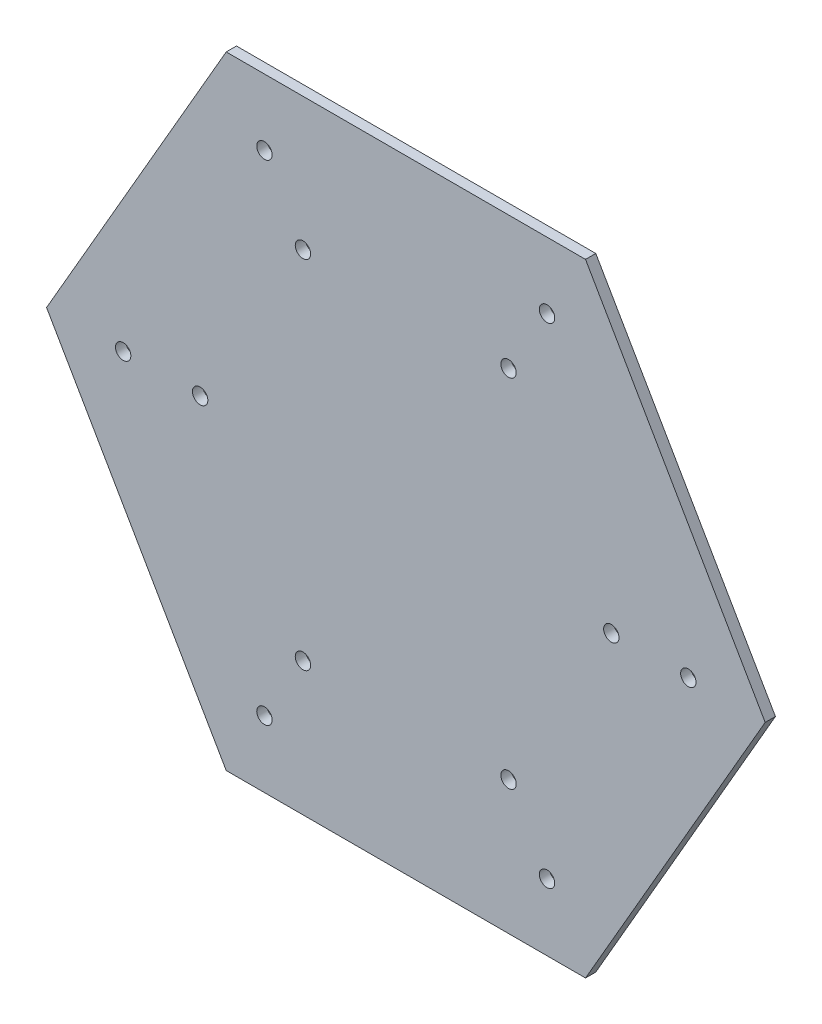
ISO-10303-21;
HEADER;
FILE_DESCRIPTION(('STEP AP214'),'2;1');
FILE_NAME('part.step','',(''),(''),'','','');
FILE_SCHEMA(('AUTOMOTIVE_DESIGN { 1 0 10303 214 1 1 1 1 }'));
ENDSEC;
DATA;
#1=APPLICATION_CONTEXT('core data for automotive mechanical design processes');
#2=APPLICATION_PROTOCOL_DEFINITION('international standard','automotive_design',2000,#1);
#3=PRODUCT_CONTEXT('',#1,'mechanical');
#4=PRODUCT('Part','Part','',(#3));
#5=PRODUCT_RELATED_PRODUCT_CATEGORY('part','',(#4));
#6=PRODUCT_DEFINITION_FORMATION('','',#4);
#7=PRODUCT_DEFINITION_CONTEXT('part definition',#1,'design');
#8=PRODUCT_DEFINITION('design','',#6,#7);
#9=PRODUCT_DEFINITION_SHAPE('','',#8);
#10=(LENGTH_UNIT() NAMED_UNIT(*) SI_UNIT(.MILLI.,.METRE.));
#11=(NAMED_UNIT(*) PLANE_ANGLE_UNIT() SI_UNIT($,.RADIAN.));
#12=(NAMED_UNIT(*) SI_UNIT($,.STERADIAN.) SOLID_ANGLE_UNIT());
#13=UNCERTAINTY_MEASURE_WITH_UNIT(LENGTH_MEASURE(1.E-05),#10,'distance_accuracy_value','');
#14=(GEOMETRIC_REPRESENTATION_CONTEXT(3) GLOBAL_UNCERTAINTY_ASSIGNED_CONTEXT((#13)) GLOBAL_UNIT_ASSIGNED_CONTEXT((#10,
#11,#12)) REPRESENTATION_CONTEXT('',''));
#15=CARTESIAN_POINT('',(0.,0.,0.));
#16=DIRECTION('',(0.,0.,1.));
#17=DIRECTION('',(1.,0.,0.));
#18=AXIS2_PLACEMENT_3D('',#15,#16,#17);
#19=CARTESIAN_POINT('',(-35.,-60.6217782649107,2.));
#20=DIRECTION('',(0.,1.,0.));
#21=DIRECTION('',(-1.,0.,0.));
#22=AXIS2_PLACEMENT_3D('',#19,#20,#21);
#23=PLANE('',#22);
#24=DIRECTION('',(1.,0.,0.));
#25=VECTOR('',#24,1.);
#26=CARTESIAN_POINT('',(-35.,-60.6217782649107,0.));
#27=LINE('',#26,#25);
#28=CARTESIAN_POINT('',(-35.,-60.6217782649107,0.));
#29=VERTEX_POINT('',#28);
#30=CARTESIAN_POINT('',(35.,-60.6217782649107,0.));
#31=VERTEX_POINT('',#30);
#32=EDGE_CURVE('E130',#29,#31,#27,.T.);
#33=ORIENTED_EDGE('',*,*,#32,.T.);
#34=DIRECTION('',(0.,0.,-1.));
#35=VECTOR('',#34,1.);
#36=CARTESIAN_POINT('',(35.,-60.6217782649107,2.));
#37=LINE('',#36,#35);
#38=CARTESIAN_POINT('',(35.,-60.6217782649107,2.));
#39=VERTEX_POINT('',#38);
#40=EDGE_CURVE('E11',#39,#31,#37,.T.);
#41=ORIENTED_EDGE('',*,*,#40,.F.);
#42=DIRECTION('',(1.,0.,0.));
#43=VECTOR('',#42,1.);
#44=CARTESIAN_POINT('',(-35.,-60.6217782649107,2.));
#45=LINE('',#44,#43);
#46=CARTESIAN_POINT('',(-35.,-60.6217782649107,2.));
#47=VERTEX_POINT('',#46);
#48=EDGE_CURVE('E147',#47,#39,#45,.T.);
#49=ORIENTED_EDGE('',*,*,#48,.F.);
#50=DIRECTION('',(0.,0.,-1.));
#51=VECTOR('',#50,1.);
#52=CARTESIAN_POINT('',(-35.,-60.6217782649107,2.));
#53=LINE('',#52,#51);
#54=EDGE_CURVE('E126',#47,#29,#53,.T.);
#55=ORIENTED_EDGE('',*,*,#54,.T.);
#56=EDGE_LOOP('',(#33,#41,#49,#55));
#57=FACE_BOUND('',#56,.T.);
#58=ADVANCED_FACE('F41',(#57),#23,.F.);
#59=CARTESIAN_POINT('',(35.,-60.6217782649107,2.));
#60=DIRECTION('',(-0.866025403784439,0.5,0.));
#61=DIRECTION('',(-0.5,-0.866025403784439,0.));
#62=AXIS2_PLACEMENT_3D('',#59,#60,#61);
#63=PLANE('',#62);
#64=DIRECTION('',(0.5,0.866025403784439,0.));
#65=VECTOR('',#64,1.);
#66=CARTESIAN_POINT('',(35.,-60.6217782649107,0.));
#67=LINE('',#66,#65);
#68=CARTESIAN_POINT('',(70.,0.,0.));
#69=VERTEX_POINT('',#68);
#70=EDGE_CURVE('E134',#31,#69,#67,.T.);
#71=ORIENTED_EDGE('',*,*,#70,.T.);
#72=DIRECTION('',(0.,0.,-1.));
#73=VECTOR('',#72,1.);
#74=CARTESIAN_POINT('',(70.,0.,2.));
#75=LINE('',#74,#73);
#76=CARTESIAN_POINT('',(70.,0.,2.));
#77=VERTEX_POINT('',#76);
#78=EDGE_CURVE('E50',#77,#69,#75,.T.);
#79=ORIENTED_EDGE('',*,*,#78,.F.);
#80=DIRECTION('',(0.5,0.866025403784439,0.));
#81=VECTOR('',#80,1.);
#82=CARTESIAN_POINT('',(35.,-60.6217782649107,2.));
#83=LINE('',#82,#81);
#84=EDGE_CURVE('E95',#39,#77,#83,.T.);
#85=ORIENTED_EDGE('',*,*,#84,.F.);
#86=ORIENTED_EDGE('',*,*,#40,.T.);
#87=EDGE_LOOP('',(#71,#79,#85,#86));
#88=FACE_BOUND('',#87,.T.);
#89=ADVANCED_FACE('F176',(#88),#63,.F.);
#90=CARTESIAN_POINT('',(70.,0.,2.));
#91=DIRECTION('',(-0.866025403784439,-0.5,0.));
#92=DIRECTION('',(0.5,-0.866025403784439,0.));
#93=AXIS2_PLACEMENT_3D('',#90,#91,#92);
#94=PLANE('',#93);
#95=DIRECTION('',(-0.5,0.866025403784439,0.));
#96=VECTOR('',#95,1.);
#97=CARTESIAN_POINT('',(70.,0.,0.));
#98=LINE('',#97,#96);
#99=CARTESIAN_POINT('',(35.,60.6217782649107,0.));
#100=VERTEX_POINT('',#99);
#101=EDGE_CURVE('E138',#69,#100,#98,.T.);
#102=ORIENTED_EDGE('',*,*,#101,.T.);
#103=DIRECTION('',(0.,0.,-1.));
#104=VECTOR('',#103,1.);
#105=CARTESIAN_POINT('',(35.,60.6217782649107,2.));
#106=LINE('',#105,#104);
#107=CARTESIAN_POINT('',(35.,60.6217782649107,2.));
#108=VERTEX_POINT('',#107);
#109=EDGE_CURVE('E119',#108,#100,#106,.T.);
#110=ORIENTED_EDGE('',*,*,#109,.F.);
#111=DIRECTION('',(-0.5,0.866025403784439,0.));
#112=VECTOR('',#111,1.);
#113=CARTESIAN_POINT('',(70.,0.,2.));
#114=LINE('',#113,#112);
#115=EDGE_CURVE('E108',#77,#108,#114,.T.);
#116=ORIENTED_EDGE('',*,*,#115,.F.);
#117=ORIENTED_EDGE('',*,*,#78,.T.);
#118=EDGE_LOOP('',(#102,#110,#116,#117));
#119=FACE_BOUND('',#118,.T.);
#120=ADVANCED_FACE('F157',(#119),#94,.F.);
#121=CARTESIAN_POINT('',(35.,60.6217782649107,2.));
#122=DIRECTION('',(0.,-1.,0.));
#123=DIRECTION('',(1.,0.,0.));
#124=AXIS2_PLACEMENT_3D('',#121,#122,#123);
#125=PLANE('',#124);
#126=DIRECTION('',(-1.,0.,0.));
#127=VECTOR('',#126,1.);
#128=CARTESIAN_POINT('',(35.,60.6217782649107,0.));
#129=LINE('',#128,#127);
#130=CARTESIAN_POINT('',(-35.,60.6217782649107,0.));
#131=VERTEX_POINT('',#130);
#132=EDGE_CURVE('E117',#100,#131,#129,.T.);
#133=ORIENTED_EDGE('',*,*,#132,.T.);
#134=DIRECTION('',(0.,0.,-1.));
#135=VECTOR('',#134,1.);
#136=CARTESIAN_POINT('',(-35.,60.6217782649107,2.));
#137=LINE('',#136,#135);
#138=CARTESIAN_POINT('',(-35.,60.6217782649107,2.));
#139=VERTEX_POINT('',#138);
#140=EDGE_CURVE('E114',#139,#131,#137,.T.);
#141=ORIENTED_EDGE('',*,*,#140,.F.);
#142=DIRECTION('',(-1.,0.,0.));
#143=VECTOR('',#142,1.);
#144=CARTESIAN_POINT('',(35.,60.6217782649107,2.));
#145=LINE('',#144,#143);
#146=EDGE_CURVE('E102',#108,#139,#145,.T.);
#147=ORIENTED_EDGE('',*,*,#146,.F.);
#148=ORIENTED_EDGE('',*,*,#109,.T.);
#149=EDGE_LOOP('',(#133,#141,#147,#148));
#150=FACE_BOUND('',#149,.T.);
#151=ADVANCED_FACE('F115',(#150),#125,.F.);
#152=CARTESIAN_POINT('',(-35.,60.6217782649107,2.));
#153=DIRECTION('',(0.866025403784438,-0.5,0.));
#154=DIRECTION('',(0.5,0.866025403784439,0.));
#155=AXIS2_PLACEMENT_3D('',#152,#153,#154);
#156=PLANE('',#155);
#157=DIRECTION('',(-0.5,-0.866025403784439,0.));
#158=VECTOR('',#157,1.);
#159=CARTESIAN_POINT('',(-35.,60.6217782649107,0.));
#160=LINE('',#159,#158);
#161=CARTESIAN_POINT('',(-70.,0.,0.));
#162=VERTEX_POINT('',#161);
#163=EDGE_CURVE('E81',#131,#162,#160,.T.);
#164=ORIENTED_EDGE('',*,*,#163,.T.);
#165=DIRECTION('',(0.,0.,-1.));
#166=VECTOR('',#165,1.);
#167=CARTESIAN_POINT('',(-70.,0.,2.));
#168=LINE('',#167,#166);
#169=CARTESIAN_POINT('',(-70.,0.,2.));
#170=VERTEX_POINT('',#169);
#171=EDGE_CURVE('E120',#170,#162,#168,.T.);
#172=ORIENTED_EDGE('',*,*,#171,.F.);
#173=DIRECTION('',(-0.5,-0.866025403784439,0.));
#174=VECTOR('',#173,1.);
#175=CARTESIAN_POINT('',(-35.,60.6217782649107,2.));
#176=LINE('',#175,#174);
#177=EDGE_CURVE('E106',#139,#170,#176,.T.);
#178=ORIENTED_EDGE('',*,*,#177,.F.);
#179=ORIENTED_EDGE('',*,*,#140,.T.);
#180=EDGE_LOOP('',(#164,#172,#178,#179));
#181=FACE_BOUND('',#180,.T.);
#182=ADVANCED_FACE('F122',(#181),#156,.F.);
#183=CARTESIAN_POINT('',(-70.,0.,2.));
#184=DIRECTION('',(0.866025403784439,0.5,0.));
#185=DIRECTION('',(-0.5,0.866025403784439,0.));
#186=AXIS2_PLACEMENT_3D('',#183,#184,#185);
#187=PLANE('',#186);
#188=DIRECTION('',(0.5,-0.866025403784439,0.));
#189=VECTOR('',#188,1.);
#190=CARTESIAN_POINT('',(-70.,0.,0.));
#191=LINE('',#190,#189);
#192=EDGE_CURVE('E87',#162,#29,#191,.T.);
#193=ORIENTED_EDGE('',*,*,#192,.T.);
#194=ORIENTED_EDGE('',*,*,#54,.F.);
#195=DIRECTION('',(0.5,-0.866025403784439,0.));
#196=VECTOR('',#195,1.);
#197=CARTESIAN_POINT('',(-70.,0.,2.));
#198=LINE('',#197,#196);
#199=EDGE_CURVE('E58',#170,#47,#198,.T.);
#200=ORIENTED_EDGE('',*,*,#199,.F.);
#201=ORIENTED_EDGE('',*,*,#171,.T.);
#202=EDGE_LOOP('',(#193,#194,#200,#201));
#203=FACE_BOUND('',#202,.T.);
#204=ADVANCED_FACE('F164',(#203),#187,.F.);
#205=CARTESIAN_POINT('',(0.,0.,2.));
#206=DIRECTION('',(0.,0.,1.));
#207=DIRECTION('',(1.,0.,0.));
#208=AXIS2_PLACEMENT_3D('',#205,#206,#207);
#209=PLANE('',#208);
#210=CARTESIAN_POINT('',(55.0264034441536,0.0457321067688558,2.));
#211=DIRECTION('',(0.,0.,1.));
#212=DIRECTION('',(0.499999999999998,0.86602540378444,0.));
#213=AXIS2_PLACEMENT_3D('',#210,#211,#212);
#214=CIRCLE('',#213,1.5);
#215=CARTESIAN_POINT('',(55.7764034441536,1.34477021244552,2.));
#216=VERTEX_POINT('',#215);
#217=EDGE_CURVE('E340',#216,#216,#214,.T.);
#218=ORIENTED_EDGE('',*,*,#217,.F.);
#219=EDGE_LOOP('',(#218));
#220=FACE_BOUND('',#219,.T.);
#221=CARTESIAN_POINT('',(-20.0528068883067,-34.6410161513778,2.));
#222=DIRECTION('',(0.,0.,1.));
#223=DIRECTION('',(0.50000000000001,-0.866025403784433,0.));
#224=AXIS2_PLACEMENT_3D('',#221,#222,#223);
#225=CIRCLE('',#224,1.5);
#226=CARTESIAN_POINT('',(-19.3028068883067,-35.9400542570545,2.));
#227=VERTEX_POINT('',#226);
#228=EDGE_CURVE('E355',#227,#227,#225,.T.);
#229=ORIENTED_EDGE('',*,*,#228,.F.);
#230=EDGE_LOOP('',(#229));
#231=FACE_BOUND('',#230,.T.);
#232=CARTESIAN_POINT('',(40.0264034441536,0.045732106768828,2.));
#233=DIRECTION('',(0.,0.,1.));
#234=DIRECTION('',(0.499999999999998,0.86602540378444,0.));
#235=AXIS2_PLACEMENT_3D('',#232,#233,#234);
#236=CIRCLE('',#235,1.5);
#237=CARTESIAN_POINT('',(40.7764034441536,1.34477021244549,2.));
#238=VERTEX_POINT('',#237);
#239=EDGE_CURVE('E345',#238,#238,#236,.T.);
#240=ORIENTED_EDGE('',*,*,#239,.F.);
#241=EDGE_LOOP('',(#240));
#242=FACE_BOUND('',#241,.T.);
#243=CARTESIAN_POINT('',(27.4999999999998,47.7228614216818,2.));
#244=DIRECTION('',(0.,0.,1.));
#245=DIRECTION('',(-0.500000000000004,0.866025403784436,0.));
#246=AXIS2_PLACEMENT_3D('',#243,#244,#245);
#247=CIRCLE('',#246,1.5);
#248=CARTESIAN_POINT('',(26.7499999999998,49.0218995273584,2.));
#249=VERTEX_POINT('',#248);
#250=EDGE_CURVE('E399',#249,#249,#247,.T.);
#251=ORIENTED_EDGE('',*,*,#250,.F.);
#252=EDGE_LOOP('',(#251));
#253=FACE_BOUND('',#252,.T.);
#254=CARTESIAN_POINT('',(19.9999999999999,34.7324803649152,2.));
#255=DIRECTION('',(0.,0.,1.));
#256=DIRECTION('',(-0.500000000000004,0.866025403784436,0.));
#257=AXIS2_PLACEMENT_3D('',#254,#255,#256);
#258=CIRCLE('',#257,1.5);
#259=CARTESIAN_POINT('',(19.2499999999999,36.0315184705918,2.));
#260=VERTEX_POINT('',#259);
#261=EDGE_CURVE('E407',#260,#260,#258,.T.);
#262=ORIENTED_EDGE('',*,*,#261,.F.);
#263=EDGE_LOOP('',(#262));
#264=FACE_BOUND('',#263,.T.);
#265=CARTESIAN_POINT('',(-27.5528068883071,47.7228614216816,2.));
#266=DIRECTION('',(0.,0.,1.));
#267=DIRECTION('',(-1.,0.,0.));
#268=AXIS2_PLACEMENT_3D('',#265,#266,#267);
#269=CIRCLE('',#268,1.5);
#270=CARTESIAN_POINT('',(-29.0528068883071,47.7228614216816,2.));
#271=VERTEX_POINT('',#270);
#272=EDGE_CURVE('E415',#271,#271,#269,.T.);
#273=ORIENTED_EDGE('',*,*,#272,.F.);
#274=EDGE_LOOP('',(#273));
#275=FACE_BOUND('',#274,.T.);
#276=CARTESIAN_POINT('',(-27.5528068883065,-47.6313972081445,2.));
#277=DIRECTION('',(0.,0.,1.));
#278=DIRECTION('',(0.50000000000001,-0.866025403784433,0.));
#279=AXIS2_PLACEMENT_3D('',#276,#277,#278);
#280=CIRCLE('',#279,1.5);
#281=CARTESIAN_POINT('',(-26.8028068883065,-48.9304353138211,2.));
#282=VERTEX_POINT('',#281);
#283=EDGE_CURVE('E373',#282,#282,#280,.T.);
#284=ORIENTED_EDGE('',*,*,#283,.F.);
#285=EDGE_LOOP('',(#284));
#286=FACE_BOUND('',#285,.T.);
#287=CARTESIAN_POINT('',(-40.0792103324607,0.0457321067683768,2.));
#288=DIRECTION('',(0.,0.,1.));
#289=DIRECTION('',(-0.499999999999992,-0.866025403784443,0.));
#290=AXIS2_PLACEMENT_3D('',#287,#288,#289);
#291=CIRCLE('',#290,1.5);
#292=CARTESIAN_POINT('',(-40.8292103324606,-1.25330599890829,2.));
#293=VERTEX_POINT('',#292);
#294=EDGE_CURVE('E364',#293,#293,#291,.T.);
#295=ORIENTED_EDGE('',*,*,#294,.F.);
#296=EDGE_LOOP('',(#295));
#297=FACE_BOUND('',#296,.T.);
#298=CARTESIAN_POINT('',(-55.0792103324606,0.0457321067682415,2.));
#299=DIRECTION('',(0.,0.,1.));
#300=DIRECTION('',(-0.499999999999992,-0.866025403784443,0.));
#301=AXIS2_PLACEMENT_3D('',#298,#299,#300);
#302=CIRCLE('',#301,1.5);
#303=CARTESIAN_POINT('',(-55.8292103324606,-1.25330599890843,2.));
#304=VERTEX_POINT('',#303);
#305=EDGE_CURVE('E389',#304,#304,#302,.T.);
#306=ORIENTED_EDGE('',*,*,#305,.F.);
#307=EDGE_LOOP('',(#306));
#308=FACE_BOUND('',#307,.T.);
#309=CARTESIAN_POINT('',(-20.0528068883071,34.7324803649151,2.));
#310=DIRECTION('',(0.,0.,1.));
#311=DIRECTION('',(-1.,0.,0.));
#312=AXIS2_PLACEMENT_3D('',#309,#310,#311);
#313=CIRCLE('',#312,1.5);
#314=CARTESIAN_POINT('',(-21.5528068883071,34.7324803649151,2.));
#315=VERTEX_POINT('',#314);
#316=EDGE_CURVE('E380',#315,#315,#313,.T.);
#317=ORIENTED_EDGE('',*,*,#316,.F.);
#318=EDGE_LOOP('',(#317));
#319=FACE_BOUND('',#318,.T.);
#320=CARTESIAN_POINT('',(27.5,-47.6313972081442,2.));
#321=DIRECTION('',(0.,0.,1.));
#322=DIRECTION('',(1.,0.,0.));
#323=AXIS2_PLACEMENT_3D('',#320,#321,#322);
#324=CIRCLE('',#323,1.5);
#325=CARTESIAN_POINT('',(29.,-47.6313972081442,2.));
#326=VERTEX_POINT('',#325);
#327=EDGE_CURVE('E135',#326,#326,#324,.T.);
#328=ORIENTED_EDGE('',*,*,#327,.F.);
#329=EDGE_LOOP('',(#328));
#330=FACE_BOUND('',#329,.T.);
#331=CARTESIAN_POINT('',(20.,-34.6410161513776,2.));
#332=DIRECTION('',(0.,0.,1.));
#333=DIRECTION('',(1.,0.,0.));
#334=AXIS2_PLACEMENT_3D('',#331,#332,#333);
#335=CIRCLE('',#334,1.5);
#336=CARTESIAN_POINT('',(21.5,-34.6410161513776,2.));
#337=VERTEX_POINT('',#336);
#338=EDGE_CURVE('E429',#337,#337,#335,.T.);
#339=ORIENTED_EDGE('',*,*,#338,.F.);
#340=EDGE_LOOP('',(#339));
#341=FACE_BOUND('',#340,.T.);
#342=ORIENTED_EDGE('',*,*,#48,.T.);
#343=ORIENTED_EDGE('',*,*,#84,.T.);
#344=ORIENTED_EDGE('',*,*,#115,.T.);
#345=ORIENTED_EDGE('',*,*,#146,.T.);
#346=ORIENTED_EDGE('',*,*,#177,.T.);
#347=ORIENTED_EDGE('',*,*,#199,.T.);
#348=EDGE_LOOP('',(#342,#343,#344,#345,#346,#347));
#349=FACE_BOUND('',#348,.T.);
#350=ADVANCED_FACE('F104',(#220,#231,#242,#253,#264,#275,#286,#297,#308,#319,#330,#341,#349),
#209,.T.);
#351=CARTESIAN_POINT('',(0.,0.,0.));
#352=DIRECTION('',(0.,0.,1.));
#353=DIRECTION('',(1.,0.,0.));
#354=AXIS2_PLACEMENT_3D('',#351,#352,#353);
#355=PLANE('',#354);
#356=CARTESIAN_POINT('',(55.0264034441536,0.0457321067688558,0.));
#357=DIRECTION('',(0.,0.,1.));
#358=DIRECTION('',(0.499999999999998,0.86602540378444,0.));
#359=AXIS2_PLACEMENT_3D('',#356,#357,#358);
#360=CIRCLE('',#359,1.5);
#361=CARTESIAN_POINT('',(55.7764034441536,1.34477021244552,0.));
#362=VERTEX_POINT('',#361);
#363=EDGE_CURVE('E343',#362,#362,#360,.T.);
#364=ORIENTED_EDGE('',*,*,#363,.T.);
#365=EDGE_LOOP('',(#364));
#366=FACE_BOUND('',#365,.T.);
#367=CARTESIAN_POINT('',(-20.0528068883067,-34.6410161513778,0.));
#368=DIRECTION('',(0.,0.,1.));
#369=DIRECTION('',(0.50000000000001,-0.866025403784433,0.));
#370=AXIS2_PLACEMENT_3D('',#367,#368,#369);
#371=CIRCLE('',#370,1.5);
#372=CARTESIAN_POINT('',(-19.3028068883067,-35.9400542570545,0.));
#373=VERTEX_POINT('',#372);
#374=EDGE_CURVE('E360',#373,#373,#371,.T.);
#375=ORIENTED_EDGE('',*,*,#374,.T.);
#376=EDGE_LOOP('',(#375));
#377=FACE_BOUND('',#376,.T.);
#378=CARTESIAN_POINT('',(40.0264034441536,0.045732106768828,0.));
#379=DIRECTION('',(0.,0.,1.));
#380=DIRECTION('',(0.499999999999998,0.86602540378444,0.));
#381=AXIS2_PLACEMENT_3D('',#378,#379,#380);
#382=CIRCLE('',#381,1.5);
#383=CARTESIAN_POINT('',(40.7764034441536,1.34477021244549,0.));
#384=VERTEX_POINT('',#383);
#385=EDGE_CURVE('E352',#384,#384,#382,.T.);
#386=ORIENTED_EDGE('',*,*,#385,.T.);
#387=EDGE_LOOP('',(#386));
#388=FACE_BOUND('',#387,.T.);
#389=CARTESIAN_POINT('',(27.4999999999998,47.7228614216818,0.));
#390=DIRECTION('',(0.,0.,1.));
#391=DIRECTION('',(-0.500000000000004,0.866025403784436,0.));
#392=AXIS2_PLACEMENT_3D('',#389,#390,#391);
#393=CIRCLE('',#392,1.5);
#394=CARTESIAN_POINT('',(26.7499999999998,49.0218995273584,0.));
#395=VERTEX_POINT('',#394);
#396=EDGE_CURVE('E403',#395,#395,#393,.T.);
#397=ORIENTED_EDGE('',*,*,#396,.T.);
#398=EDGE_LOOP('',(#397));
#399=FACE_BOUND('',#398,.T.);
#400=CARTESIAN_POINT('',(19.9999999999999,34.7324803649152,0.));
#401=DIRECTION('',(0.,0.,1.));
#402=DIRECTION('',(-0.500000000000004,0.866025403784436,0.));
#403=AXIS2_PLACEMENT_3D('',#400,#401,#402);
#404=CIRCLE('',#403,1.5);
#405=CARTESIAN_POINT('',(19.2499999999999,36.0315184705918,0.));
#406=VERTEX_POINT('',#405);
#407=EDGE_CURVE('E411',#406,#406,#404,.T.);
#408=ORIENTED_EDGE('',*,*,#407,.T.);
#409=EDGE_LOOP('',(#408));
#410=FACE_BOUND('',#409,.T.);
#411=CARTESIAN_POINT('',(-27.5528068883071,47.7228614216816,0.));
#412=DIRECTION('',(0.,0.,1.));
#413=DIRECTION('',(-1.,0.,0.));
#414=AXIS2_PLACEMENT_3D('',#411,#412,#413);
#415=CIRCLE('',#414,1.5);
#416=CARTESIAN_POINT('',(-29.0528068883071,47.7228614216816,0.));
#417=VERTEX_POINT('',#416);
#418=EDGE_CURVE('E384',#417,#417,#415,.T.);
#419=ORIENTED_EDGE('',*,*,#418,.T.);
#420=EDGE_LOOP('',(#419));
#421=FACE_BOUND('',#420,.T.);
#422=CARTESIAN_POINT('',(-27.5528068883065,-47.6313972081445,0.));
#423=DIRECTION('',(0.,0.,1.));
#424=DIRECTION('',(0.50000000000001,-0.866025403784433,0.));
#425=AXIS2_PLACEMENT_3D('',#422,#423,#424);
#426=CIRCLE('',#425,1.5);
#427=CARTESIAN_POINT('',(-26.8028068883065,-48.9304353138211,0.));
#428=VERTEX_POINT('',#427);
#429=EDGE_CURVE('E359',#428,#428,#426,.T.);
#430=ORIENTED_EDGE('',*,*,#429,.T.);
#431=EDGE_LOOP('',(#430));
#432=FACE_BOUND('',#431,.T.);
#433=CARTESIAN_POINT('',(-40.0792103324607,0.0457321067683768,0.));
#434=DIRECTION('',(0.,0.,1.));
#435=DIRECTION('',(-0.499999999999992,-0.866025403784443,0.));
#436=AXIS2_PLACEMENT_3D('',#433,#434,#435);
#437=CIRCLE('',#436,1.5);
#438=CARTESIAN_POINT('',(-40.8292103324606,-1.25330599890829,0.));
#439=VERTEX_POINT('',#438);
#440=EDGE_CURVE('E369',#439,#439,#437,.T.);
#441=ORIENTED_EDGE('',*,*,#440,.T.);
#442=EDGE_LOOP('',(#441));
#443=FACE_BOUND('',#442,.T.);
#444=CARTESIAN_POINT('',(-55.0792103324606,0.0457321067682415,0.));
#445=DIRECTION('',(0.,0.,1.));
#446=DIRECTION('',(-0.499999999999992,-0.866025403784443,0.));
#447=AXIS2_PLACEMENT_3D('',#444,#445,#446);
#448=CIRCLE('',#447,1.5);
#449=CARTESIAN_POINT('',(-55.8292103324606,-1.25330599890843,0.));
#450=VERTEX_POINT('',#449);
#451=EDGE_CURVE('E368',#450,#450,#448,.T.);
#452=ORIENTED_EDGE('',*,*,#451,.T.);
#453=EDGE_LOOP('',(#452));
#454=FACE_BOUND('',#453,.T.);
#455=CARTESIAN_POINT('',(-20.0528068883071,34.7324803649151,0.));
#456=DIRECTION('',(0.,0.,1.));
#457=DIRECTION('',(-1.,0.,0.));
#458=AXIS2_PLACEMENT_3D('',#455,#456,#457);
#459=CIRCLE('',#458,1.5);
#460=CARTESIAN_POINT('',(-21.5528068883071,34.7324803649151,0.));
#461=VERTEX_POINT('',#460);
#462=EDGE_CURVE('E385',#461,#461,#459,.T.);
#463=ORIENTED_EDGE('',*,*,#462,.T.);
#464=EDGE_LOOP('',(#463));
#465=FACE_BOUND('',#464,.T.);
#466=CARTESIAN_POINT('',(27.5,-47.6313972081442,0.));
#467=DIRECTION('',(0.,0.,1.));
#468=DIRECTION('',(1.,0.,0.));
#469=AXIS2_PLACEMENT_3D('',#466,#467,#468);
#470=CIRCLE('',#469,1.5);
#471=CARTESIAN_POINT('',(29.,-47.6313972081442,0.));
#472=VERTEX_POINT('',#471);
#473=EDGE_CURVE('E425',#472,#472,#470,.T.);
#474=ORIENTED_EDGE('',*,*,#473,.T.);
#475=EDGE_LOOP('',(#474));
#476=FACE_BOUND('',#475,.T.);
#477=CARTESIAN_POINT('',(20.,-34.6410161513776,0.));
#478=DIRECTION('',(0.,0.,1.));
#479=DIRECTION('',(1.,0.,0.));
#480=AXIS2_PLACEMENT_3D('',#477,#478,#479);
#481=CIRCLE('',#480,1.5);
#482=CARTESIAN_POINT('',(21.5,-34.6410161513776,0.));
#483=VERTEX_POINT('',#482);
#484=EDGE_CURVE('E349',#483,#483,#481,.T.);
#485=ORIENTED_EDGE('',*,*,#484,.T.);
#486=EDGE_LOOP('',(#485));
#487=FACE_BOUND('',#486,.T.);
#488=ORIENTED_EDGE('',*,*,#32,.F.);
#489=ORIENTED_EDGE('',*,*,#192,.F.);
#490=ORIENTED_EDGE('',*,*,#163,.F.);
#491=ORIENTED_EDGE('',*,*,#132,.F.);
#492=ORIENTED_EDGE('',*,*,#101,.F.);
#493=ORIENTED_EDGE('',*,*,#70,.F.);
#494=EDGE_LOOP('',(#488,#489,#490,#491,#492,#493));
#495=FACE_BOUND('',#494,.T.);
#496=ADVANCED_FACE('F160',(#366,#377,#388,#399,#410,#421,#432,#443,#454,#465,#476,#487,#495),
#355,.F.);
#497=CARTESIAN_POINT('',(20.,-34.6410161513776,2.));
#498=DIRECTION('',(0.,0.,-1.));
#499=DIRECTION('',(-1.,0.,0.));
#500=AXIS2_PLACEMENT_3D('',#497,#498,#499);
#501=CYLINDRICAL_SURFACE('',#500,1.5);
#502=ORIENTED_EDGE('',*,*,#338,.T.);
#503=EDGE_LOOP('',(#502));
#504=FACE_BOUND('',#503,.T.);
#505=ORIENTED_EDGE('',*,*,#484,.F.);
#506=EDGE_LOOP('',(#505));
#507=FACE_BOUND('',#506,.T.);
#508=ADVANCED_FACE('F204',(#504,#507),#501,.F.);
#509=CARTESIAN_POINT('',(27.5,-47.6313972081442,2.));
#510=DIRECTION('',(0.,0.,-1.));
#511=DIRECTION('',(-1.,0.,0.));
#512=AXIS2_PLACEMENT_3D('',#509,#510,#511);
#513=CYLINDRICAL_SURFACE('',#512,1.5);
#514=ORIENTED_EDGE('',*,*,#327,.T.);
#515=EDGE_LOOP('',(#514));
#516=FACE_BOUND('',#515,.T.);
#517=ORIENTED_EDGE('',*,*,#473,.F.);
#518=EDGE_LOOP('',(#517));
#519=FACE_BOUND('',#518,.T.);
#520=ADVANCED_FACE('F209',(#516,#519),#513,.F.);
#521=CARTESIAN_POINT('',(-20.0528068883071,34.7324803649151,2.));
#522=DIRECTION('',(0.,0.,-1.));
#523=DIRECTION('',(-1.,0.,0.));
#524=AXIS2_PLACEMENT_3D('',#521,#522,#523);
#525=CYLINDRICAL_SURFACE('',#524,1.5);
#526=ORIENTED_EDGE('',*,*,#316,.T.);
#527=EDGE_LOOP('',(#526));
#528=FACE_BOUND('',#527,.T.);
#529=ORIENTED_EDGE('',*,*,#462,.F.);
#530=EDGE_LOOP('',(#529));
#531=FACE_BOUND('',#530,.T.);
#532=ADVANCED_FACE('F221',(#528,#531),#525,.F.);
#533=CARTESIAN_POINT('',(-55.0792103324606,0.0457321067682415,2.));
#534=DIRECTION('',(0.,0.,-1.));
#535=DIRECTION('',(-1.,0.,0.));
#536=AXIS2_PLACEMENT_3D('',#533,#534,#535);
#537=CYLINDRICAL_SURFACE('',#536,1.5);
#538=ORIENTED_EDGE('',*,*,#305,.T.);
#539=EDGE_LOOP('',(#538));
#540=FACE_BOUND('',#539,.T.);
#541=ORIENTED_EDGE('',*,*,#451,.F.);
#542=EDGE_LOOP('',(#541));
#543=FACE_BOUND('',#542,.T.);
#544=ADVANCED_FACE('F243',(#540,#543),#537,.F.);
#545=CARTESIAN_POINT('',(-40.0792103324607,0.0457321067683768,2.));
#546=DIRECTION('',(0.,0.,-1.));
#547=DIRECTION('',(-1.,0.,0.));
#548=AXIS2_PLACEMENT_3D('',#545,#546,#547);
#549=CYLINDRICAL_SURFACE('',#548,1.5);
#550=ORIENTED_EDGE('',*,*,#294,.T.);
#551=EDGE_LOOP('',(#550));
#552=FACE_BOUND('',#551,.T.);
#553=ORIENTED_EDGE('',*,*,#440,.F.);
#554=EDGE_LOOP('',(#553));
#555=FACE_BOUND('',#554,.T.);
#556=ADVANCED_FACE('F253',(#552,#555),#549,.F.);
#557=CARTESIAN_POINT('',(-27.5528068883065,-47.6313972081445,2.));
#558=DIRECTION('',(0.,0.,-1.));
#559=DIRECTION('',(-1.,0.,0.));
#560=AXIS2_PLACEMENT_3D('',#557,#558,#559);
#561=CYLINDRICAL_SURFACE('',#560,1.5);
#562=ORIENTED_EDGE('',*,*,#283,.T.);
#563=EDGE_LOOP('',(#562));
#564=FACE_BOUND('',#563,.T.);
#565=ORIENTED_EDGE('',*,*,#429,.F.);
#566=EDGE_LOOP('',(#565));
#567=FACE_BOUND('',#566,.T.);
#568=ADVANCED_FACE('F263',(#564,#567),#561,.F.);
#569=CARTESIAN_POINT('',(-27.5528068883071,47.7228614216816,2.));
#570=DIRECTION('',(0.,0.,-1.));
#571=DIRECTION('',(-1.,0.,0.));
#572=AXIS2_PLACEMENT_3D('',#569,#570,#571);
#573=CYLINDRICAL_SURFACE('',#572,1.5);
#574=ORIENTED_EDGE('',*,*,#272,.T.);
#575=EDGE_LOOP('',(#574));
#576=FACE_BOUND('',#575,.T.);
#577=ORIENTED_EDGE('',*,*,#418,.F.);
#578=EDGE_LOOP('',(#577));
#579=FACE_BOUND('',#578,.T.);
#580=ADVANCED_FACE('F273',(#576,#579),#573,.F.);
#581=CARTESIAN_POINT('',(19.9999999999999,34.7324803649152,2.));
#582=DIRECTION('',(0.,0.,-1.));
#583=DIRECTION('',(-1.,0.,0.));
#584=AXIS2_PLACEMENT_3D('',#581,#582,#583);
#585=CYLINDRICAL_SURFACE('',#584,1.5);
#586=ORIENTED_EDGE('',*,*,#261,.T.);
#587=EDGE_LOOP('',(#586));
#588=FACE_BOUND('',#587,.T.);
#589=ORIENTED_EDGE('',*,*,#407,.F.);
#590=EDGE_LOOP('',(#589));
#591=FACE_BOUND('',#590,.T.);
#592=ADVANCED_FACE('F283',(#588,#591),#585,.F.);
#593=CARTESIAN_POINT('',(27.4999999999998,47.7228614216818,2.));
#594=DIRECTION('',(0.,0.,-1.));
#595=DIRECTION('',(-1.,0.,0.));
#596=AXIS2_PLACEMENT_3D('',#593,#594,#595);
#597=CYLINDRICAL_SURFACE('',#596,1.5);
#598=ORIENTED_EDGE('',*,*,#250,.T.);
#599=EDGE_LOOP('',(#598));
#600=FACE_BOUND('',#599,.T.);
#601=ORIENTED_EDGE('',*,*,#396,.F.);
#602=EDGE_LOOP('',(#601));
#603=FACE_BOUND('',#602,.T.);
#604=ADVANCED_FACE('F293',(#600,#603),#597,.F.);
#605=CARTESIAN_POINT('',(40.0264034441536,0.045732106768828,2.));
#606=DIRECTION('',(0.,0.,-1.));
#607=DIRECTION('',(-1.,0.,0.));
#608=AXIS2_PLACEMENT_3D('',#605,#606,#607);
#609=CYLINDRICAL_SURFACE('',#608,1.5);
#610=ORIENTED_EDGE('',*,*,#239,.T.);
#611=EDGE_LOOP('',(#610));
#612=FACE_BOUND('',#611,.T.);
#613=ORIENTED_EDGE('',*,*,#385,.F.);
#614=EDGE_LOOP('',(#613));
#615=FACE_BOUND('',#614,.T.);
#616=ADVANCED_FACE('F303',(#612,#615),#609,.F.);
#617=CARTESIAN_POINT('',(-20.0528068883067,-34.6410161513778,2.));
#618=DIRECTION('',(0.,0.,-1.));
#619=DIRECTION('',(-1.,0.,0.));
#620=AXIS2_PLACEMENT_3D('',#617,#618,#619);
#621=CYLINDRICAL_SURFACE('',#620,1.5);
#622=ORIENTED_EDGE('',*,*,#228,.T.);
#623=EDGE_LOOP('',(#622));
#624=FACE_BOUND('',#623,.T.);
#625=ORIENTED_EDGE('',*,*,#374,.F.);
#626=EDGE_LOOP('',(#625));
#627=FACE_BOUND('',#626,.T.);
#628=ADVANCED_FACE('F313',(#624,#627),#621,.F.);
#629=CARTESIAN_POINT('',(55.0264034441536,0.0457321067688558,2.));
#630=DIRECTION('',(0.,0.,-1.));
#631=DIRECTION('',(-1.,0.,0.));
#632=AXIS2_PLACEMENT_3D('',#629,#630,#631);
#633=CYLINDRICAL_SURFACE('',#632,1.5);
#634=ORIENTED_EDGE('',*,*,#217,.T.);
#635=EDGE_LOOP('',(#634));
#636=FACE_BOUND('',#635,.T.);
#637=ORIENTED_EDGE('',*,*,#363,.F.);
#638=EDGE_LOOP('',(#637));
#639=FACE_BOUND('',#638,.T.);
#640=ADVANCED_FACE('F323',(#636,#639),#633,.F.);
#641=CLOSED_SHELL('',(#58,#89,#120,#151,#182,#204,#350,#496,#508,#520,#532,#544,#556,#568,#580,
#592,#604,#616,#628,#640));
#642=MANIFOLD_SOLID_BREP('B2',#641);
#643=ADVANCED_BREP_SHAPE_REPRESENTATION('',(#18,#642),#14);
#644=SHAPE_DEFINITION_REPRESENTATION(#9,#643);
ENDSEC;
END-ISO-10303-21;
